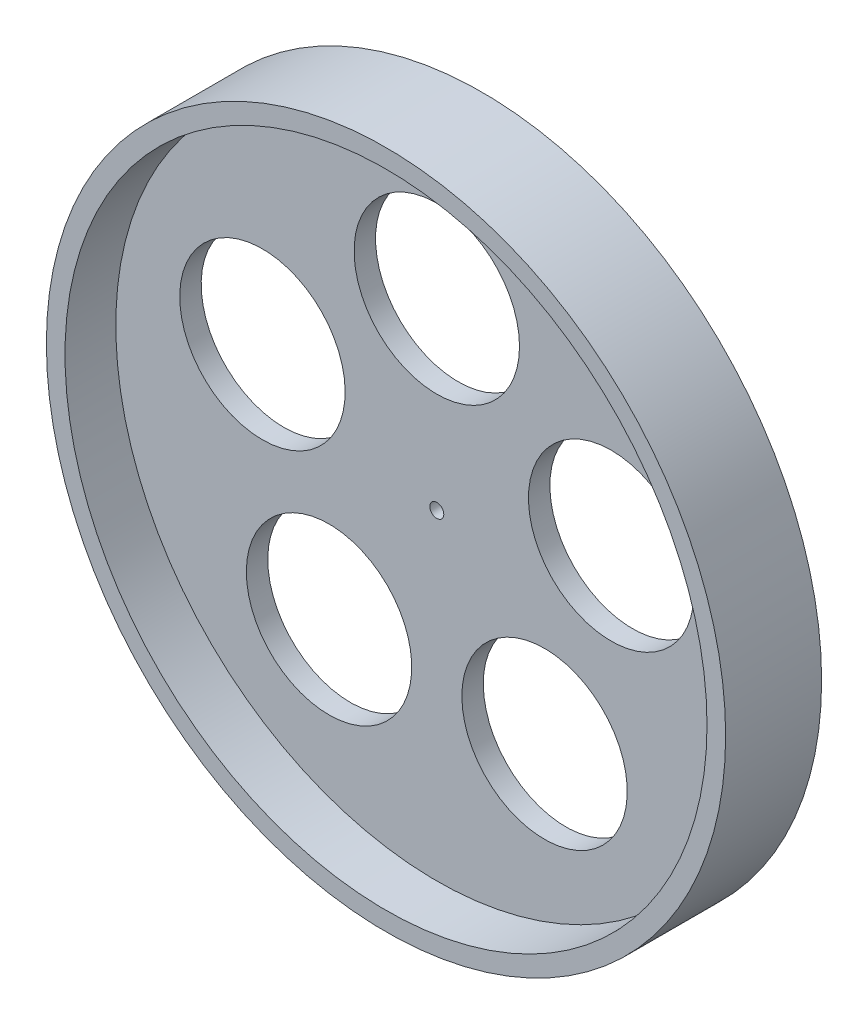
ISO-10303-21;
HEADER;
FILE_DESCRIPTION(('STEP AP214'),'2;1');
FILE_NAME('part.step','',(''),(''),'','','');
FILE_SCHEMA(('AUTOMOTIVE_DESIGN { 1 0 10303 214 1 1 1 1 }'));
ENDSEC;
DATA;
#1=APPLICATION_CONTEXT('core data for automotive mechanical design processes');
#2=APPLICATION_PROTOCOL_DEFINITION('international standard','automotive_design',2000,#1);
#3=PRODUCT_CONTEXT('',#1,'mechanical');
#4=PRODUCT('Part','Part','',(#3));
#5=PRODUCT_RELATED_PRODUCT_CATEGORY('part','',(#4));
#6=PRODUCT_DEFINITION_FORMATION('','',#4);
#7=PRODUCT_DEFINITION_CONTEXT('part definition',#1,'design');
#8=PRODUCT_DEFINITION('design','',#6,#7);
#9=PRODUCT_DEFINITION_SHAPE('','',#8);
#10=(LENGTH_UNIT() NAMED_UNIT(*) SI_UNIT(.MILLI.,.METRE.));
#11=(NAMED_UNIT(*) PLANE_ANGLE_UNIT() SI_UNIT($,.RADIAN.));
#12=(NAMED_UNIT(*) SI_UNIT($,.STERADIAN.) SOLID_ANGLE_UNIT());
#13=UNCERTAINTY_MEASURE_WITH_UNIT(LENGTH_MEASURE(1.E-05),#10,'distance_accuracy_value','');
#14=(GEOMETRIC_REPRESENTATION_CONTEXT(3) GLOBAL_UNCERTAINTY_ASSIGNED_CONTEXT((#13)) GLOBAL_UNIT_ASSIGNED_CONTEXT((#10,
#11,#12)) REPRESENTATION_CONTEXT('',''));
#15=CARTESIAN_POINT('',(0.,0.,0.));
#16=DIRECTION('',(0.,0.,1.));
#17=DIRECTION('',(1.,0.,0.));
#18=AXIS2_PLACEMENT_3D('',#15,#16,#17);
#19=CARTESIAN_POINT('',(0.,0.,2.3));
#20=DIRECTION('',(0.,0.,1.));
#21=DIRECTION('',(1.,0.,0.));
#22=AXIS2_PLACEMENT_3D('',#19,#20,#21);
#23=PLANE('',#22);
#24=CARTESIAN_POINT('',(0.,0.,2.3));
#25=DIRECTION('',(0.,0.,1.));
#26=DIRECTION('',(1.,0.,0.));
#27=AXIS2_PLACEMENT_3D('',#24,#25,#26);
#28=CIRCLE('',#27,1.5);
#29=CARTESIAN_POINT('',(1.5,0.,2.3));
#30=VERTEX_POINT('',#29);
#31=EDGE_CURVE('E94',#30,#30,#28,.T.);
#32=ORIENTED_EDGE('',*,*,#31,.F.);
#33=EDGE_LOOP('',(#32));
#34=FACE_BOUND('',#33,.T.);
#35=CARTESIAN_POINT('',(37.4240739162142,12.1598187286546,2.3));
#36=DIRECTION('',(0.,0.,1.));
#37=DIRECTION('',(0.309016994374958,-0.95105651629515,0.));
#38=AXIS2_PLACEMENT_3D('',#35,#36,#37);
#39=CIRCLE('',#38,17.75);
#40=CARTESIAN_POINT('',(42.9091255663697,-4.72143443558431,2.3));
#41=VERTEX_POINT('',#40);
#42=EDGE_CURVE('E58',#41,#41,#39,.T.);
#43=ORIENTED_EDGE('',*,*,#42,.F.);
#44=EDGE_LOOP('',(#43));
#45=FACE_BOUND('',#44,.T.);
#46=CARTESIAN_POINT('',(23.1293496777091,-31.834818728654,2.3));
#47=DIRECTION('',(0.,0.,1.));
#48=DIRECTION('',(-0.809016994374942,-0.58778525229248,0.));
#49=AXIS2_PLACEMENT_3D('',#46,#47,#48);
#50=CIRCLE('',#49,17.75);
#51=CARTESIAN_POINT('',(8.76929802755388,-42.2680069568455,2.3));
#52=VERTEX_POINT('',#51);
#53=EDGE_CURVE('E65',#52,#52,#50,.T.);
#54=ORIENTED_EDGE('',*,*,#53,.F.);
#55=EDGE_LOOP('',(#54));
#56=FACE_BOUND('',#55,.T.);
#57=CARTESIAN_POINT('',(-23.1293496777086,-31.8348187286543,2.3));
#58=DIRECTION('',(0.,0.,1.));
#59=DIRECTION('',(-0.809016994374951,0.587785252292469,0.));
#60=AXIS2_PLACEMENT_3D('',#57,#58,#59);
#61=CIRCLE('',#60,17.75);
#62=CARTESIAN_POINT('',(-37.489401327864,-21.401630500463,2.3));
#63=VERTEX_POINT('',#62);
#64=EDGE_CURVE('E71',#63,#63,#61,.T.);
#65=ORIENTED_EDGE('',*,*,#64,.F.);
#66=EDGE_LOOP('',(#65));
#67=FACE_BOUND('',#66,.T.);
#68=CARTESIAN_POINT('',(-37.4240739162143,12.1598187286541,2.3));
#69=DIRECTION('',(0.,0.,1.));
#70=DIRECTION('',(0.309016994374945,0.951056516295155,0.));
#71=AXIS2_PLACEMENT_3D('',#68,#69,#70);
#72=CIRCLE('',#71,17.75);
#73=CARTESIAN_POINT('',(-31.9390222660591,29.0410718928931,2.3));
#74=VERTEX_POINT('',#73);
#75=EDGE_CURVE('E52',#74,#74,#72,.T.);
#76=ORIENTED_EDGE('',*,*,#75,.F.);
#77=EDGE_LOOP('',(#76));
#78=FACE_BOUND('',#77,.T.);
#79=CARTESIAN_POINT('',(0.,39.35,2.3));
#80=DIRECTION('',(0.,0.,1.));
#81=DIRECTION('',(1.,0.,0.));
#82=AXIS2_PLACEMENT_3D('',#79,#80,#81);
#83=CIRCLE('',#82,17.75);
#84=CARTESIAN_POINT('',(17.75,39.35,2.3));
#85=VERTEX_POINT('',#84);
#86=EDGE_CURVE('E46',#85,#85,#83,.T.);
#87=ORIENTED_EDGE('',*,*,#86,.F.);
#88=EDGE_LOOP('',(#87));
#89=FACE_BOUND('',#88,.T.);
#90=CARTESIAN_POINT('',(0.,0.,2.3));
#91=DIRECTION('',(0.,0.,1.));
#92=DIRECTION('',(1.,0.,0.));
#93=AXIS2_PLACEMENT_3D('',#90,#91,#92);
#94=CIRCLE('',#93,68.9);
#95=CARTESIAN_POINT('',(68.9,0.,2.3));
#96=VERTEX_POINT('',#95);
#97=EDGE_CURVE('E62',#96,#96,#94,.T.);
#98=ORIENTED_EDGE('',*,*,#97,.T.);
#99=EDGE_LOOP('',(#98));
#100=FACE_BOUND('',#99,.T.);
#101=ADVANCED_FACE('F31',(#34,#45,#56,#67,#78,#89,#100),#23,.T.);
#102=CARTESIAN_POINT('',(0.,0.,-2.3));
#103=DIRECTION('',(0.,0.,1.));
#104=DIRECTION('',(1.,0.,0.));
#105=AXIS2_PLACEMENT_3D('',#102,#103,#104);
#106=PLANE('',#105);
#107=CARTESIAN_POINT('',(0.,0.,-2.3));
#108=DIRECTION('',(0.,0.,1.));
#109=DIRECTION('',(1.,0.,0.));
#110=AXIS2_PLACEMENT_3D('',#107,#108,#109);
#111=CIRCLE('',#110,11.65);
#112=CARTESIAN_POINT('',(11.65,0.,-2.3));
#113=VERTEX_POINT('',#112);
#114=EDGE_CURVE('E10',#113,#113,#111,.F.);
#115=ORIENTED_EDGE('',*,*,#114,.F.);
#116=EDGE_LOOP('',(#115));
#117=FACE_BOUND('',#116,.T.);
#118=CARTESIAN_POINT('',(37.4240739162142,12.1598187286546,-2.3));
#119=DIRECTION('',(0.,0.,1.));
#120=DIRECTION('',(0.309016994374958,-0.95105651629515,0.));
#121=AXIS2_PLACEMENT_3D('',#118,#119,#120);
#122=CIRCLE('',#121,17.75);
#123=CARTESIAN_POINT('',(42.9091255663697,-4.72143443558431,-2.3));
#124=VERTEX_POINT('',#123);
#125=EDGE_CURVE('E61',#124,#124,#122,.T.);
#126=ORIENTED_EDGE('',*,*,#125,.T.);
#127=EDGE_LOOP('',(#126));
#128=FACE_BOUND('',#127,.T.);
#129=CARTESIAN_POINT('',(23.1293496777091,-31.834818728654,-2.3));
#130=DIRECTION('',(0.,0.,1.));
#131=DIRECTION('',(-0.809016994374942,-0.58778525229248,0.));
#132=AXIS2_PLACEMENT_3D('',#129,#130,#131);
#133=CIRCLE('',#132,17.75);
#134=CARTESIAN_POINT('',(8.76929802755388,-42.2680069568455,-2.3));
#135=VERTEX_POINT('',#134);
#136=EDGE_CURVE('E68',#135,#135,#133,.T.);
#137=ORIENTED_EDGE('',*,*,#136,.T.);
#138=EDGE_LOOP('',(#137));
#139=FACE_BOUND('',#138,.T.);
#140=CARTESIAN_POINT('',(-23.1293496777086,-31.8348187286543,-2.3));
#141=DIRECTION('',(0.,0.,1.));
#142=DIRECTION('',(-0.809016994374951,0.587785252292469,0.));
#143=AXIS2_PLACEMENT_3D('',#140,#141,#142);
#144=CIRCLE('',#143,17.75);
#145=CARTESIAN_POINT('',(-37.489401327864,-21.401630500463,-2.3));
#146=VERTEX_POINT('',#145);
#147=EDGE_CURVE('E55',#146,#146,#144,.T.);
#148=ORIENTED_EDGE('',*,*,#147,.T.);
#149=EDGE_LOOP('',(#148));
#150=FACE_BOUND('',#149,.T.);
#151=CARTESIAN_POINT('',(-37.4240739162143,12.1598187286541,-2.3));
#152=DIRECTION('',(0.,0.,1.));
#153=DIRECTION('',(0.309016994374945,0.951056516295155,0.));
#154=AXIS2_PLACEMENT_3D('',#151,#152,#153);
#155=CIRCLE('',#154,17.75);
#156=CARTESIAN_POINT('',(-31.9390222660591,29.0410718928931,-2.3));
#157=VERTEX_POINT('',#156);
#158=EDGE_CURVE('E50',#157,#157,#155,.T.);
#159=ORIENTED_EDGE('',*,*,#158,.T.);
#160=EDGE_LOOP('',(#159));
#161=FACE_BOUND('',#160,.T.);
#162=CARTESIAN_POINT('',(0.,39.35,-2.3));
#163=DIRECTION('',(0.,0.,1.));
#164=DIRECTION('',(1.,0.,0.));
#165=AXIS2_PLACEMENT_3D('',#162,#163,#164);
#166=CIRCLE('',#165,17.75);
#167=CARTESIAN_POINT('',(17.75,39.35,-2.3));
#168=VERTEX_POINT('',#167);
#169=EDGE_CURVE('E42',#168,#168,#166,.T.);
#170=ORIENTED_EDGE('',*,*,#169,.T.);
#171=EDGE_LOOP('',(#170));
#172=FACE_BOUND('',#171,.T.);
#173=CARTESIAN_POINT('',(0.,0.,-2.3));
#174=DIRECTION('',(0.,0.,1.));
#175=DIRECTION('',(1.,0.,0.));
#176=AXIS2_PLACEMENT_3D('',#173,#174,#175);
#177=CIRCLE('',#176,68.9);
#178=CARTESIAN_POINT('',(68.9,0.,-2.3));
#179=VERTEX_POINT('',#178);
#180=EDGE_CURVE('E38',#179,#179,#177,.T.);
#181=ORIENTED_EDGE('',*,*,#180,.F.);
#182=EDGE_LOOP('',(#181));
#183=FACE_BOUND('',#182,.T.);
#184=ADVANCED_FACE('F33',(#117,#128,#139,#150,#161,#172,#183),#106,.F.);
#185=CARTESIAN_POINT('',(0.,39.35,-2.3));
#186=DIRECTION('',(0.,0.,1.));
#187=DIRECTION('',(1.,0.,0.));
#188=AXIS2_PLACEMENT_3D('',#185,#186,#187);
#189=CYLINDRICAL_SURFACE('',#188,17.75);
#190=ORIENTED_EDGE('',*,*,#169,.F.);
#191=EDGE_LOOP('',(#190));
#192=FACE_BOUND('',#191,.T.);
#193=ORIENTED_EDGE('',*,*,#86,.T.);
#194=EDGE_LOOP('',(#193));
#195=FACE_BOUND('',#194,.T.);
#196=ADVANCED_FACE('F165',(#192,#195),#189,.F.);
#197=CARTESIAN_POINT('',(-37.4240739162143,12.1598187286541,-2.3));
#198=DIRECTION('',(0.,0.,1.));
#199=DIRECTION('',(1.,0.,0.));
#200=AXIS2_PLACEMENT_3D('',#197,#198,#199);
#201=CYLINDRICAL_SURFACE('',#200,17.75);
#202=ORIENTED_EDGE('',*,*,#158,.F.);
#203=EDGE_LOOP('',(#202));
#204=FACE_BOUND('',#203,.T.);
#205=ORIENTED_EDGE('',*,*,#75,.T.);
#206=EDGE_LOOP('',(#205));
#207=FACE_BOUND('',#206,.T.);
#208=ADVANCED_FACE('F154',(#204,#207),#201,.F.);
#209=CARTESIAN_POINT('',(-23.1293496777086,-31.8348187286543,-2.3));
#210=DIRECTION('',(0.,0.,1.));
#211=DIRECTION('',(1.,0.,0.));
#212=AXIS2_PLACEMENT_3D('',#209,#210,#211);
#213=CYLINDRICAL_SURFACE('',#212,17.75);
#214=ORIENTED_EDGE('',*,*,#147,.F.);
#215=EDGE_LOOP('',(#214));
#216=FACE_BOUND('',#215,.T.);
#217=ORIENTED_EDGE('',*,*,#64,.T.);
#218=EDGE_LOOP('',(#217));
#219=FACE_BOUND('',#218,.T.);
#220=ADVANCED_FACE('F150',(#216,#219),#213,.F.);
#221=CARTESIAN_POINT('',(23.1293496777091,-31.834818728654,-2.3));
#222=DIRECTION('',(0.,0.,1.));
#223=DIRECTION('',(1.,0.,0.));
#224=AXIS2_PLACEMENT_3D('',#221,#222,#223);
#225=CYLINDRICAL_SURFACE('',#224,17.75);
#226=ORIENTED_EDGE('',*,*,#136,.F.);
#227=EDGE_LOOP('',(#226));
#228=FACE_BOUND('',#227,.T.);
#229=ORIENTED_EDGE('',*,*,#53,.T.);
#230=EDGE_LOOP('',(#229));
#231=FACE_BOUND('',#230,.T.);
#232=ADVANCED_FACE('F153',(#228,#231),#225,.F.);
#233=CARTESIAN_POINT('',(37.4240739162142,12.1598187286546,-2.3));
#234=DIRECTION('',(0.,0.,1.));
#235=DIRECTION('',(1.,0.,0.));
#236=AXIS2_PLACEMENT_3D('',#233,#234,#235);
#237=CYLINDRICAL_SURFACE('',#236,17.75);
#238=ORIENTED_EDGE('',*,*,#125,.F.);
#239=EDGE_LOOP('',(#238));
#240=FACE_BOUND('',#239,.T.);
#241=ORIENTED_EDGE('',*,*,#42,.T.);
#242=EDGE_LOOP('',(#241));
#243=FACE_BOUND('',#242,.T.);
#244=ADVANCED_FACE('F158',(#240,#243),#237,.F.);
#245=CARTESIAN_POINT('',(0.,0.,-7.4));
#246=DIRECTION('',(0.,0.,1.));
#247=DIRECTION('',(1.,0.,0.));
#248=AXIS2_PLACEMENT_3D('',#245,#246,#247);
#249=CYLINDRICAL_SURFACE('',#248,68.9);
#250=CARTESIAN_POINT('',(0.,0.,-7.4));
#251=DIRECTION('',(0.,0.,1.));
#252=DIRECTION('',(1.,0.,0.));
#253=AXIS2_PLACEMENT_3D('',#250,#251,#252);
#254=CIRCLE('',#253,68.9);
#255=CARTESIAN_POINT('',(68.9,0.,-7.4));
#256=VERTEX_POINT('',#255);
#257=EDGE_CURVE('E81',#256,#256,#254,.T.);
#258=ORIENTED_EDGE('',*,*,#257,.F.);
#259=EDGE_LOOP('',(#258));
#260=FACE_BOUND('',#259,.T.);
#261=ORIENTED_EDGE('',*,*,#180,.T.);
#262=EDGE_LOOP('',(#261));
#263=FACE_BOUND('',#262,.T.);
#264=ADVANCED_FACE('F129',(#260,#263),#249,.F.);
#265=CARTESIAN_POINT('',(0.,0.,-7.4));
#266=DIRECTION('',(0.,0.,1.));
#267=DIRECTION('',(1.,0.,0.));
#268=AXIS2_PLACEMENT_3D('',#265,#266,#267);
#269=CYLINDRICAL_SURFACE('',#268,72.9);
#270=CARTESIAN_POINT('',(0.,0.,-7.4));
#271=DIRECTION('',(0.,0.,1.));
#272=DIRECTION('',(1.,0.,0.));
#273=AXIS2_PLACEMENT_3D('',#270,#271,#272);
#274=CIRCLE('',#273,72.9);
#275=CARTESIAN_POINT('',(72.9,0.,-7.4));
#276=VERTEX_POINT('',#275);
#277=EDGE_CURVE('E78',#276,#276,#274,.T.);
#278=ORIENTED_EDGE('',*,*,#277,.T.);
#279=EDGE_LOOP('',(#278));
#280=FACE_BOUND('',#279,.T.);
#281=CARTESIAN_POINT('',(0.,0.,13.2));
#282=DIRECTION('',(0.,0.,1.));
#283=DIRECTION('',(1.,0.,0.));
#284=AXIS2_PLACEMENT_3D('',#281,#282,#283);
#285=CIRCLE('',#284,72.9);
#286=CARTESIAN_POINT('',(72.9,0.,13.2));
#287=VERTEX_POINT('',#286);
#288=EDGE_CURVE('E84',#287,#287,#285,.T.);
#289=ORIENTED_EDGE('',*,*,#288,.F.);
#290=EDGE_LOOP('',(#289));
#291=FACE_BOUND('',#290,.T.);
#292=ADVANCED_FACE('F145',(#280,#291),#269,.T.);
#293=CARTESIAN_POINT('',(0.,0.,-7.4));
#294=DIRECTION('',(0.,0.,1.));
#295=DIRECTION('',(1.,0.,0.));
#296=AXIS2_PLACEMENT_3D('',#293,#294,#295);
#297=PLANE('',#296);
#298=ORIENTED_EDGE('',*,*,#257,.T.);
#299=EDGE_LOOP('',(#298));
#300=FACE_BOUND('',#299,.T.);
#301=ORIENTED_EDGE('',*,*,#277,.F.);
#302=EDGE_LOOP('',(#301));
#303=FACE_BOUND('',#302,.T.);
#304=ADVANCED_FACE('F127',(#300,#303),#297,.F.);
#305=ORIENTED_EDGE('',*,*,#97,.F.);
#306=EDGE_LOOP('',(#305));
#307=FACE_BOUND('',#306,.T.);
#308=CARTESIAN_POINT('',(0.,0.,13.2));
#309=DIRECTION('',(0.,0.,1.));
#310=DIRECTION('',(1.,0.,0.));
#311=AXIS2_PLACEMENT_3D('',#308,#309,#310);
#312=CIRCLE('',#311,68.9);
#313=CARTESIAN_POINT('',(68.9,0.,13.2));
#314=VERTEX_POINT('',#313);
#315=EDGE_CURVE('E87',#314,#314,#312,.T.);
#316=ORIENTED_EDGE('',*,*,#315,.T.);
#317=EDGE_LOOP('',(#316));
#318=FACE_BOUND('',#317,.T.);
#319=ADVANCED_FACE('F123',(#307,#318),#249,.F.);
#320=CARTESIAN_POINT('',(0.,0.,13.2));
#321=DIRECTION('',(0.,0.,1.));
#322=DIRECTION('',(1.,0.,0.));
#323=AXIS2_PLACEMENT_3D('',#320,#321,#322);
#324=PLANE('',#323);
#325=ORIENTED_EDGE('',*,*,#288,.T.);
#326=EDGE_LOOP('',(#325));
#327=FACE_BOUND('',#326,.T.);
#328=ORIENTED_EDGE('',*,*,#315,.F.);
#329=EDGE_LOOP('',(#328));
#330=FACE_BOUND('',#329,.T.);
#331=ADVANCED_FACE('F126',(#327,#330),#324,.T.);
#332=CARTESIAN_POINT('',(0.,0.,-10.3));
#333=DIRECTION('',(0.,0.,1.));
#334=DIRECTION('',(1.,0.,0.));
#335=AXIS2_PLACEMENT_3D('',#332,#333,#334);
#336=CYLINDRICAL_SURFACE('',#335,11.65);
#337=CARTESIAN_POINT('',(0.,0.,-10.3));
#338=DIRECTION('',(0.,0.,-1.));
#339=DIRECTION('',(-1.,0.,0.));
#340=AXIS2_PLACEMENT_3D('',#337,#338,#339);
#341=CIRCLE('',#340,11.65);
#342=CARTESIAN_POINT('',(-11.65,0.,-10.3));
#343=VERTEX_POINT('',#342);
#344=EDGE_CURVE('E90',#343,#343,#341,.T.);
#345=ORIENTED_EDGE('',*,*,#344,.F.);
#346=EDGE_LOOP('',(#345));
#347=FACE_BOUND('',#346,.T.);
#348=ORIENTED_EDGE('',*,*,#114,.T.);
#349=EDGE_LOOP('',(#348));
#350=FACE_BOUND('',#349,.T.);
#351=ADVANCED_FACE('F133',(#347,#350),#336,.T.);
#352=CARTESIAN_POINT('',(0.,0.,-10.3));
#353=DIRECTION('',(0.,0.,-1.));
#354=DIRECTION('',(-1.,0.,0.));
#355=AXIS2_PLACEMENT_3D('',#352,#353,#354);
#356=PLANE('',#355);
#357=CARTESIAN_POINT('',(0.,0.,-10.3));
#358=DIRECTION('',(0.,0.,1.));
#359=DIRECTION('',(1.,0.,0.));
#360=AXIS2_PLACEMENT_3D('',#357,#358,#359);
#361=CIRCLE('',#360,1.5);
#362=CARTESIAN_POINT('',(1.5,0.,-10.3));
#363=VERTEX_POINT('',#362);
#364=EDGE_CURVE('E93',#363,#363,#361,.T.);
#365=ORIENTED_EDGE('',*,*,#364,.T.);
#366=EDGE_LOOP('',(#365));
#367=FACE_BOUND('',#366,.T.);
#368=ORIENTED_EDGE('',*,*,#344,.T.);
#369=EDGE_LOOP('',(#368));
#370=FACE_BOUND('',#369,.T.);
#371=ADVANCED_FACE('F100',(#367,#370),#356,.T.);
#372=CARTESIAN_POINT('',(0.,0.,-10.3));
#373=DIRECTION('',(0.,0.,1.));
#374=DIRECTION('',(1.,0.,0.));
#375=AXIS2_PLACEMENT_3D('',#372,#373,#374);
#376=CYLINDRICAL_SURFACE('',#375,1.5);
#377=ORIENTED_EDGE('',*,*,#364,.F.);
#378=EDGE_LOOP('',(#377));
#379=FACE_BOUND('',#378,.T.);
#380=ORIENTED_EDGE('',*,*,#31,.T.);
#381=EDGE_LOOP('',(#380));
#382=FACE_BOUND('',#381,.T.);
#383=ADVANCED_FACE('F103',(#379,#382),#376,.F.);
#384=CLOSED_SHELL('',(#101,#184,#196,#208,#220,#232,#244,#264,#292,#304,#319,#331,#351,#371,#383));
#385=MANIFOLD_SOLID_BREP('B2',#384);
#386=ADVANCED_BREP_SHAPE_REPRESENTATION('',(#18,#385),#14);
#387=SHAPE_DEFINITION_REPRESENTATION(#9,#386);
ENDSEC;
END-ISO-10303-21;
